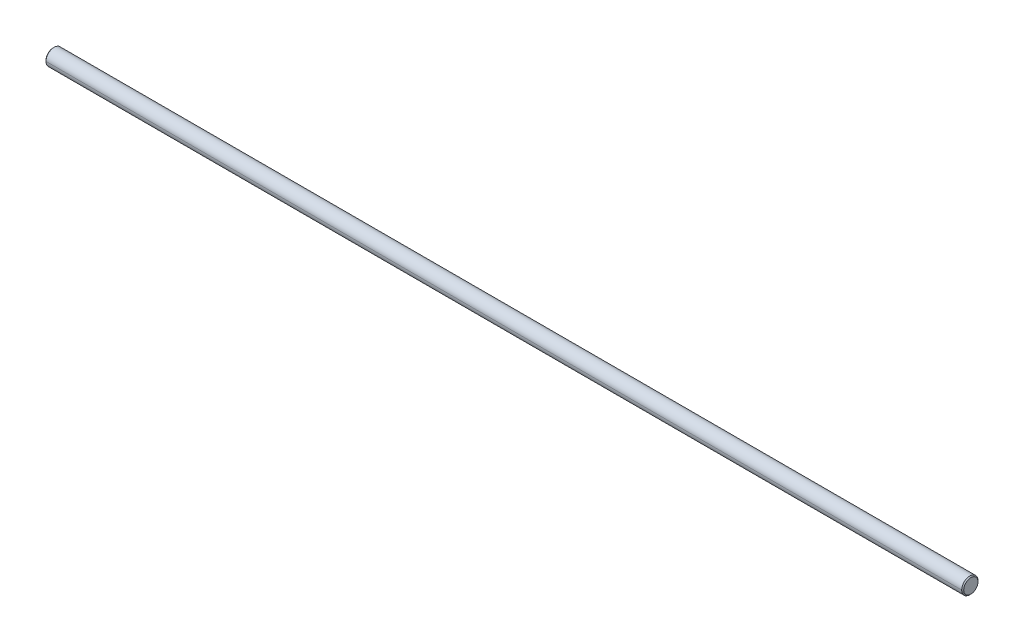
ISO-10303-21;
HEADER;
FILE_DESCRIPTION(('STEP AP214'),'2;1');
FILE_NAME('part.step','',(''),(''),'','','');
FILE_SCHEMA(('AUTOMOTIVE_DESIGN { 1 0 10303 214 1 1 1 1 }'));
ENDSEC;
DATA;
#1=APPLICATION_CONTEXT('core data for automotive mechanical design processes');
#2=APPLICATION_PROTOCOL_DEFINITION('international standard','automotive_design',2000,#1);
#3=PRODUCT_CONTEXT('',#1,'mechanical');
#4=PRODUCT('Part','Part','',(#3));
#5=PRODUCT_RELATED_PRODUCT_CATEGORY('part','',(#4));
#6=PRODUCT_DEFINITION_FORMATION('','',#4);
#7=PRODUCT_DEFINITION_CONTEXT('part definition',#1,'design');
#8=PRODUCT_DEFINITION('design','',#6,#7);
#9=PRODUCT_DEFINITION_SHAPE('','',#8);
#10=(LENGTH_UNIT() NAMED_UNIT(*) SI_UNIT(.MILLI.,.METRE.));
#11=(NAMED_UNIT(*) PLANE_ANGLE_UNIT() SI_UNIT($,.RADIAN.));
#12=(NAMED_UNIT(*) SI_UNIT($,.STERADIAN.) SOLID_ANGLE_UNIT());
#13=UNCERTAINTY_MEASURE_WITH_UNIT(LENGTH_MEASURE(1.E-05),#10,'distance_accuracy_value','');
#14=(GEOMETRIC_REPRESENTATION_CONTEXT(3) GLOBAL_UNCERTAINTY_ASSIGNED_CONTEXT((#13)) GLOBAL_UNIT_ASSIGNED_CONTEXT((#10,
#11,#12)) REPRESENTATION_CONTEXT('',''));
#15=CARTESIAN_POINT('',(0.,0.,0.));
#16=DIRECTION('',(0.,0.,1.));
#17=DIRECTION('',(1.,0.,0.));
#18=AXIS2_PLACEMENT_3D('',#15,#16,#17);
#19=CARTESIAN_POINT('',(449.5,0.,0.));
#20=DIRECTION('',(-1.,0.,0.));
#21=DIRECTION('',(0.,0.,1.));
#22=AXIS2_PLACEMENT_3D('',#19,#20,#21);
#23=CONICAL_SURFACE('',#22,4.,0.785398163397);
#24=DIRECTION('',(-0.707106781186548,0.,-0.707106781186548));
#25=VECTOR('',#24,1.);
#26=CARTESIAN_POINT('',(449.25,0.,-4.25));
#27=LINE('',#26,#25);
#28=CARTESIAN_POINT('',(450.,0.,-3.5));
#29=VERTEX_POINT('',#28);
#30=CARTESIAN_POINT('',(449.5,0.,-4.));
#31=VERTEX_POINT('',#30);
#32=EDGE_CURVE('E154',#29,#31,#27,.T.);
#33=ORIENTED_EDGE('',*,*,#32,.T.);
#34=CARTESIAN_POINT('',(449.5,0.,0.));
#35=DIRECTION('',(1.,0.,0.));
#36=DIRECTION('',(0.,1.,0.));
#37=AXIS2_PLACEMENT_3D('',#34,#35,#36);
#38=CIRCLE('',#37,4.);
#39=CARTESIAN_POINT('',(449.5,0.,4.));
#40=VERTEX_POINT('',#39);
#41=EDGE_CURVE('E11',#31,#40,#38,.T.);
#42=ORIENTED_EDGE('',*,*,#41,.T.);
#43=DIRECTION('',(-0.707106781186548,0.,0.707106781186548));
#44=VECTOR('',#43,1.);
#45=CARTESIAN_POINT('',(449.25,0.,4.25));
#46=LINE('',#45,#44);
#47=CARTESIAN_POINT('',(450.,0.,3.5));
#48=VERTEX_POINT('',#47);
#49=EDGE_CURVE('E167',#48,#40,#46,.T.);
#50=ORIENTED_EDGE('',*,*,#49,.F.);
#51=CARTESIAN_POINT('',(450.,0.,-3.5));
#52=CARTESIAN_POINT('',(450.,0.733019220966,-3.49995582523));
#53=CARTESIAN_POINT('',(450.,1.46615555485,-3.30827898939));
#54=CARTESIAN_POINT('',(450.,2.13193702063,-2.9237842893));
#55=CARTESIAN_POINT('',(450.,3.19717899838,-1.84589915823));
#56=CARTESIAN_POINT('',(450.,3.59806063559,-0.384417394233));
#57=CARTESIAN_POINT('',(450.,3.59806063559,0.384417394233));
#58=CARTESIAN_POINT('',(450.,3.19717899838,1.84589915823));
#59=CARTESIAN_POINT('',(450.,2.13193702063,2.9237842893));
#60=CARTESIAN_POINT('',(450.,1.46615555485,3.30827898939));
#61=CARTESIAN_POINT('',(450.,0.733019220966,3.49995582523));
#62=CARTESIAN_POINT('',(450.,0.,3.5));
#63=(BOUNDED_CURVE() B_SPLINE_CURVE(5,(#51,#52,#53,#54,#55,#56,#57,#58,#59,#60,#61,#62),
.UNSPECIFIED.,.F.,.F.) B_SPLINE_CURVE_WITH_KNOTS((6,3,3,6),(0.,3.78330528264,7.56661056529,
11.3499158479),
.UNSPECIFIED.) CURVE() GEOMETRIC_REPRESENTATION_ITEM() RATIONAL_B_SPLINE_CURVE((1.,1.,1.,1.,1.,
1.,1.,1.,1.,1.,1.,1.)) REPRESENTATION_ITEM(''));
#64=EDGE_CURVE('E44',#29,#48,#63,.T.);
#65=ORIENTED_EDGE('',*,*,#64,.F.);
#66=EDGE_LOOP('',(#33,#42,#50,#65));
#67=FACE_BOUND('',#66,.T.);
#68=ADVANCED_FACE('F17',(#67),#23,.T.);
#69=CARTESIAN_POINT('',(450.,0.,0.));
#70=DIRECTION('',(1.,0.,0.));
#71=DIRECTION('',(0.,0.,-1.));
#72=AXIS2_PLACEMENT_3D('',#69,#70,#71);
#73=CYLINDRICAL_SURFACE('',#72,4.);
#74=DIRECTION('',(1.,0.,0.));
#75=VECTOR('',#74,1.);
#76=CARTESIAN_POINT('',(225.,0.,4.));
#77=LINE('',#76,#75);
#78=CARTESIAN_POINT('',(0.5,0.,4.));
#79=VERTEX_POINT('',#78);
#80=EDGE_CURVE('E175',#79,#40,#77,.T.);
#81=ORIENTED_EDGE('',*,*,#80,.T.);
#82=ORIENTED_EDGE('',*,*,#41,.F.);
#83=DIRECTION('',(1.,0.,0.));
#84=VECTOR('',#83,1.);
#85=CARTESIAN_POINT('',(225.,0.,-4.));
#86=LINE('',#85,#84);
#87=CARTESIAN_POINT('',(0.5,0.,-4.));
#88=VERTEX_POINT('',#87);
#89=EDGE_CURVE('E164',#88,#31,#86,.T.);
#90=ORIENTED_EDGE('',*,*,#89,.F.);
#91=CARTESIAN_POINT('',(0.5,0.,0.));
#92=DIRECTION('',(1.,0.,0.));
#93=DIRECTION('',(0.,1.,0.));
#94=AXIS2_PLACEMENT_3D('',#91,#92,#93);
#95=CIRCLE('',#94,4.);
#96=EDGE_CURVE('E31',#88,#79,#95,.T.);
#97=ORIENTED_EDGE('',*,*,#96,.T.);
#98=EDGE_LOOP('',(#81,#82,#90,#97));
#99=FACE_BOUND('',#98,.T.);
#100=ADVANCED_FACE('F125',(#99),#73,.T.);
#101=CARTESIAN_POINT('',(0.,0.,0.));
#102=DIRECTION('',(1.,0.,0.));
#103=DIRECTION('',(0.,0.,-1.));
#104=AXIS2_PLACEMENT_3D('',#101,#102,#103);
#105=CONICAL_SURFACE('',#104,3.5,0.785398163397);
#106=DIRECTION('',(0.707106781186548,0.,0.707106781186548));
#107=VECTOR('',#106,1.);
#108=CARTESIAN_POINT('',(0.25,0.,3.75));
#109=LINE('',#108,#107);
#110=CARTESIAN_POINT('',(0.,0.,3.5));
#111=VERTEX_POINT('',#110);
#112=EDGE_CURVE('E88',#111,#79,#109,.T.);
#113=ORIENTED_EDGE('',*,*,#112,.T.);
#114=ORIENTED_EDGE('',*,*,#96,.F.);
#115=DIRECTION('',(0.707106781186548,0.,-0.707106781186548));
#116=VECTOR('',#115,1.);
#117=CARTESIAN_POINT('',(0.25,0.,-3.75));
#118=LINE('',#117,#116);
#119=CARTESIAN_POINT('',(0.,0.,-3.5));
#120=VERTEX_POINT('',#119);
#121=EDGE_CURVE('E78',#120,#88,#118,.T.);
#122=ORIENTED_EDGE('',*,*,#121,.F.);
#123=CARTESIAN_POINT('',(0.,0.,0.));
#124=DIRECTION('',(1.,0.,0.));
#125=DIRECTION('',(0.,0.,-1.));
#126=AXIS2_PLACEMENT_3D('',#123,#124,#125);
#127=CIRCLE('',#126,3.5);
#128=EDGE_CURVE('E80',#120,#111,#127,.T.);
#129=ORIENTED_EDGE('',*,*,#128,.T.);
#130=EDGE_LOOP('',(#113,#114,#122,#129));
#131=FACE_BOUND('',#130,.T.);
#132=ADVANCED_FACE('F19',(#131),#105,.T.);
#133=CARTESIAN_POINT('',(450.,3.5,0.));
#134=DIRECTION('',(-1.,0.,0.));
#135=DIRECTION('',(0.,0.,1.));
#136=AXIS2_PLACEMENT_3D('',#133,#134,#135);
#137=PLANE('',#136);
#138=ORIENTED_EDGE('',*,*,#64,.T.);
#139=CARTESIAN_POINT('',(450.,0.,0.));
#140=DIRECTION('',(1.,0.,0.));
#141=DIRECTION('',(0.,-1.,0.));
#142=AXIS2_PLACEMENT_3D('',#139,#140,#141);
#143=CIRCLE('',#142,3.5);
#144=EDGE_CURVE('E156',#48,#29,#143,.T.);
#145=ORIENTED_EDGE('',*,*,#144,.T.);
#146=EDGE_LOOP('',(#138,#145));
#147=FACE_BOUND('',#146,.T.);
#148=ADVANCED_FACE('F117',(#147),#137,.F.);
#149=CARTESIAN_POINT('',(449.5,0.,0.));
#150=DIRECTION('',(-1.,0.,0.));
#151=DIRECTION('',(0.,0.,-1.));
#152=AXIS2_PLACEMENT_3D('',#149,#150,#151);
#153=CONICAL_SURFACE('',#152,4.,0.785398163397);
#154=ORIENTED_EDGE('',*,*,#32,.F.);
#155=ORIENTED_EDGE('',*,*,#144,.F.);
#156=ORIENTED_EDGE('',*,*,#49,.T.);
#157=CARTESIAN_POINT('',(449.5,0.,0.));
#158=DIRECTION('',(1.,0.,0.));
#159=DIRECTION('',(0.,1.,0.));
#160=AXIS2_PLACEMENT_3D('',#157,#158,#159);
#161=CIRCLE('',#160,4.);
#162=EDGE_CURVE('E157',#40,#31,#161,.T.);
#163=ORIENTED_EDGE('',*,*,#162,.T.);
#164=EDGE_LOOP('',(#154,#155,#156,#163));
#165=FACE_BOUND('',#164,.T.);
#166=ADVANCED_FACE('F116',(#165),#153,.T.);
#167=CARTESIAN_POINT('',(450.,0.,0.));
#168=DIRECTION('',(1.,0.,0.));
#169=DIRECTION('',(0.,1.17871902273E-09,1.));
#170=AXIS2_PLACEMENT_3D('',#167,#168,#169);
#171=CYLINDRICAL_SURFACE('',#170,4.);
#172=ORIENTED_EDGE('',*,*,#80,.F.);
#173=CARTESIAN_POINT('',(0.5,0.,0.));
#174=DIRECTION('',(1.,0.,0.));
#175=DIRECTION('',(0.,1.,0.));
#176=AXIS2_PLACEMENT_3D('',#173,#174,#175);
#177=CIRCLE('',#176,4.);
#178=EDGE_CURVE('E87',#79,#88,#177,.T.);
#179=ORIENTED_EDGE('',*,*,#178,.T.);
#180=ORIENTED_EDGE('',*,*,#89,.T.);
#181=ORIENTED_EDGE('',*,*,#162,.F.);
#182=EDGE_LOOP('',(#172,#179,#180,#181));
#183=FACE_BOUND('',#182,.T.);
#184=ADVANCED_FACE('F115',(#183),#171,.T.);
#185=CARTESIAN_POINT('',(0.,0.,0.));
#186=DIRECTION('',(1.,0.,0.));
#187=DIRECTION('',(0.,0.,1.));
#188=AXIS2_PLACEMENT_3D('',#185,#186,#187);
#189=CONICAL_SURFACE('',#188,3.5,0.785398163397);
#190=ORIENTED_EDGE('',*,*,#112,.F.);
#191=CARTESIAN_POINT('',(0.,0.,0.));
#192=DIRECTION('',(1.,0.,0.));
#193=DIRECTION('',(0.,0.,1.));
#194=AXIS2_PLACEMENT_3D('',#191,#192,#193);
#195=CIRCLE('',#194,3.5);
#196=EDGE_CURVE('E93',#111,#120,#195,.T.);
#197=ORIENTED_EDGE('',*,*,#196,.T.);
#198=ORIENTED_EDGE('',*,*,#121,.T.);
#199=ORIENTED_EDGE('',*,*,#178,.F.);
#200=EDGE_LOOP('',(#190,#197,#198,#199));
#201=FACE_BOUND('',#200,.T.);
#202=ADVANCED_FACE('F98',(#201),#189,.T.);
#203=CARTESIAN_POINT('',(0.,0.,0.));
#204=DIRECTION('',(1.,0.,0.));
#205=DIRECTION('',(0.,1.,0.));
#206=AXIS2_PLACEMENT_3D('',#203,#204,#205);
#207=PLANE('',#206);
#208=ORIENTED_EDGE('',*,*,#196,.F.);
#209=ORIENTED_EDGE('',*,*,#128,.F.);
#210=EDGE_LOOP('',(#208,#209));
#211=FACE_BOUND('',#210,.T.);
#212=ADVANCED_FACE('F92',(#211),#207,.F.);
#213=CLOSED_SHELL('',(#68,#100,#132,#148,#166,#184,#202,#212));
#214=MANIFOLD_SOLID_BREP('B1',#213);
#215=ADVANCED_BREP_SHAPE_REPRESENTATION('',(#18,#214),#14);
#216=SHAPE_DEFINITION_REPRESENTATION(#9,#215);
ENDSEC;
END-ISO-10303-21;
